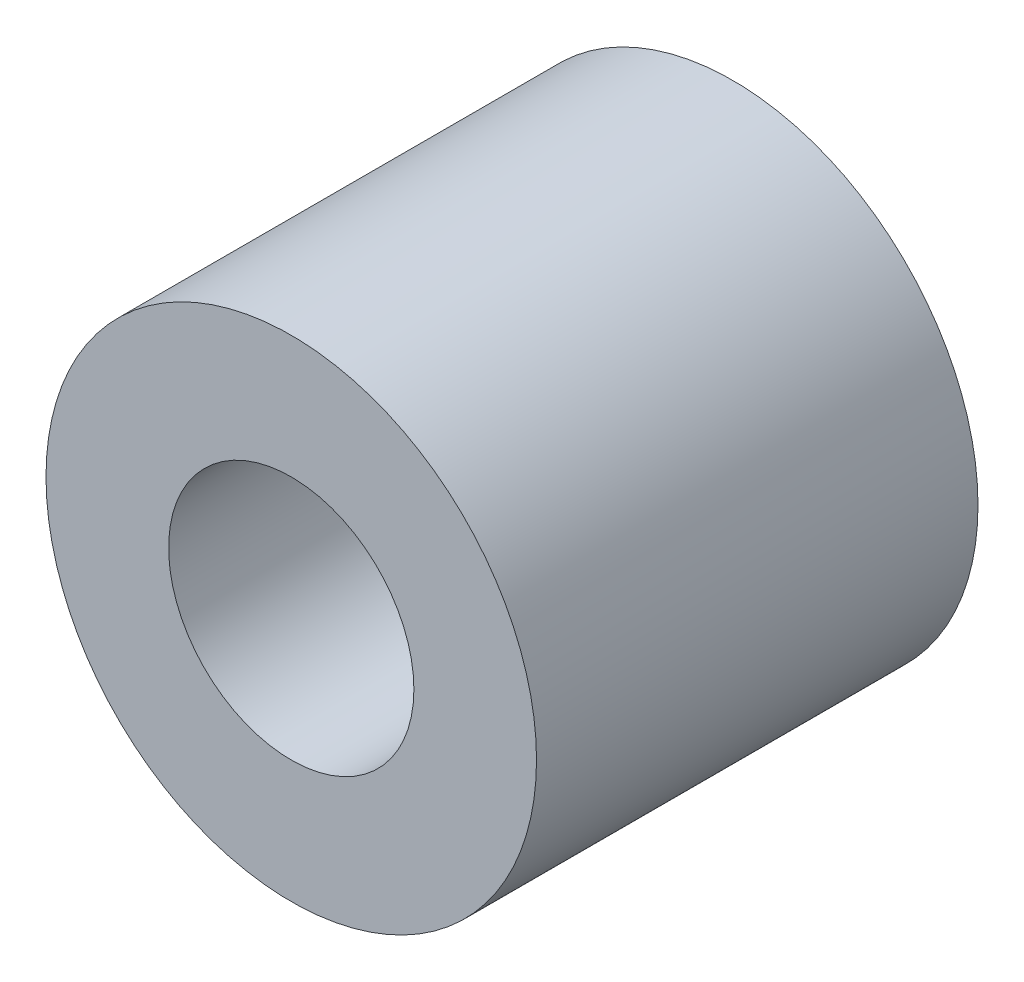
ISO-10303-21;
HEADER;
FILE_DESCRIPTION(('STEP AP214'),'2;1');
FILE_NAME('part.step','',(''),(''),'','','');
FILE_SCHEMA(('AUTOMOTIVE_DESIGN { 1 0 10303 214 1 1 1 1 }'));
ENDSEC;
DATA;
#1=APPLICATION_CONTEXT('core data for automotive mechanical design processes');
#2=APPLICATION_PROTOCOL_DEFINITION('international standard','automotive_design',2000,#1);
#3=PRODUCT_CONTEXT('',#1,'mechanical');
#4=PRODUCT('Part','Part','',(#3));
#5=PRODUCT_RELATED_PRODUCT_CATEGORY('part','',(#4));
#6=PRODUCT_DEFINITION_FORMATION('','',#4);
#7=PRODUCT_DEFINITION_CONTEXT('part definition',#1,'design');
#8=PRODUCT_DEFINITION('design','',#6,#7);
#9=PRODUCT_DEFINITION_SHAPE('','',#8);
#10=(LENGTH_UNIT() NAMED_UNIT(*) SI_UNIT(.MILLI.,.METRE.));
#11=(NAMED_UNIT(*) PLANE_ANGLE_UNIT() SI_UNIT($,.RADIAN.));
#12=(NAMED_UNIT(*) SI_UNIT($,.STERADIAN.) SOLID_ANGLE_UNIT());
#13=UNCERTAINTY_MEASURE_WITH_UNIT(LENGTH_MEASURE(1.E-05),#10,'distance_accuracy_value','');
#14=(GEOMETRIC_REPRESENTATION_CONTEXT(3) GLOBAL_UNCERTAINTY_ASSIGNED_CONTEXT((#13)) GLOBAL_UNIT_ASSIGNED_CONTEXT((#10,
#11,#12)) REPRESENTATION_CONTEXT('',''));
#15=CARTESIAN_POINT('',(0.,0.,0.));
#16=DIRECTION('',(0.,0.,1.));
#17=DIRECTION('',(1.,0.,0.));
#18=AXIS2_PLACEMENT_3D('',#15,#16,#17);
#19=CARTESIAN_POINT('',(0.,0.,9.));
#20=DIRECTION('',(0.,0.,-1.));
#21=DIRECTION('',(-1.,0.,0.));
#22=AXIS2_PLACEMENT_3D('',#19,#20,#21);
#23=CYLINDRICAL_SURFACE('',#22,5.);
#24=CARTESIAN_POINT('',(0.,0.,9.));
#25=DIRECTION('',(0.,0.,1.));
#26=DIRECTION('',(1.,0.,0.));
#27=AXIS2_PLACEMENT_3D('',#24,#25,#26);
#28=CIRCLE('',#27,5.);
#29=CARTESIAN_POINT('',(5.,0.,9.));
#30=VERTEX_POINT('',#29);
#31=EDGE_CURVE('E10',#30,#30,#28,.T.);
#32=ORIENTED_EDGE('',*,*,#31,.F.);
#33=EDGE_LOOP('',(#32));
#34=FACE_BOUND('',#33,.T.);
#35=CARTESIAN_POINT('',(0.,0.,0.));
#36=DIRECTION('',(0.,0.,1.));
#37=DIRECTION('',(1.,0.,0.));
#38=AXIS2_PLACEMENT_3D('',#35,#36,#37);
#39=CIRCLE('',#38,5.);
#40=CARTESIAN_POINT('',(5.,0.,0.));
#41=VERTEX_POINT('',#40);
#42=EDGE_CURVE('E38',#41,#41,#39,.T.);
#43=ORIENTED_EDGE('',*,*,#42,.T.);
#44=EDGE_LOOP('',(#43));
#45=FACE_BOUND('',#44,.T.);
#46=ADVANCED_FACE('F31',(#34,#45),#23,.T.);
#47=CARTESIAN_POINT('',(0.,0.,9.));
#48=DIRECTION('',(0.,0.,1.));
#49=DIRECTION('',(1.,0.,0.));
#50=AXIS2_PLACEMENT_3D('',#47,#48,#49);
#51=PLANE('',#50);
#52=CARTESIAN_POINT('',(0.,0.,9.));
#53=DIRECTION('',(0.,0.,1.));
#54=DIRECTION('',(1.,0.,0.));
#55=AXIS2_PLACEMENT_3D('',#52,#53,#54);
#56=CIRCLE('',#55,2.5);
#57=CARTESIAN_POINT('',(2.5,0.,9.));
#58=VERTEX_POINT('',#57);
#59=EDGE_CURVE('E44',#58,#58,#56,.T.);
#60=ORIENTED_EDGE('',*,*,#59,.F.);
#61=EDGE_LOOP('',(#60));
#62=FACE_BOUND('',#61,.T.);
#63=ORIENTED_EDGE('',*,*,#31,.T.);
#64=EDGE_LOOP('',(#63));
#65=FACE_BOUND('',#64,.T.);
#66=ADVANCED_FACE('F60',(#62,#65),#51,.T.);
#67=CARTESIAN_POINT('',(0.,0.,0.));
#68=DIRECTION('',(0.,0.,1.));
#69=DIRECTION('',(1.,0.,0.));
#70=AXIS2_PLACEMENT_3D('',#67,#68,#69);
#71=PLANE('',#70);
#72=CARTESIAN_POINT('',(0.,0.,0.));
#73=DIRECTION('',(0.,0.,1.));
#74=DIRECTION('',(1.,0.,0.));
#75=AXIS2_PLACEMENT_3D('',#72,#73,#74);
#76=CIRCLE('',#75,2.5);
#77=CARTESIAN_POINT('',(2.5,0.,0.));
#78=VERTEX_POINT('',#77);
#79=EDGE_CURVE('E34',#78,#78,#76,.T.);
#80=ORIENTED_EDGE('',*,*,#79,.T.);
#81=EDGE_LOOP('',(#80));
#82=FACE_BOUND('',#81,.T.);
#83=ORIENTED_EDGE('',*,*,#42,.F.);
#84=EDGE_LOOP('',(#83));
#85=FACE_BOUND('',#84,.T.);
#86=ADVANCED_FACE('F51',(#82,#85),#71,.F.);
#87=CARTESIAN_POINT('',(0.,0.,-4.));
#88=DIRECTION('',(0.,0.,1.));
#89=DIRECTION('',(1.,0.,0.));
#90=AXIS2_PLACEMENT_3D('',#87,#88,#89);
#91=CYLINDRICAL_SURFACE('',#90,2.5);
#92=ORIENTED_EDGE('',*,*,#59,.T.);
#93=EDGE_LOOP('',(#92));
#94=FACE_BOUND('',#93,.T.);
#95=ORIENTED_EDGE('',*,*,#79,.F.);
#96=EDGE_LOOP('',(#95));
#97=FACE_BOUND('',#96,.T.);
#98=ADVANCED_FACE('F54',(#94,#97),#91,.F.);
#99=CLOSED_SHELL('',(#46,#66,#86,#98));
#100=MANIFOLD_SOLID_BREP('B2',#99);
#101=ADVANCED_BREP_SHAPE_REPRESENTATION('',(#18,#100),#14);
#102=SHAPE_DEFINITION_REPRESENTATION(#9,#101);
ENDSEC;
END-ISO-10303-21;
